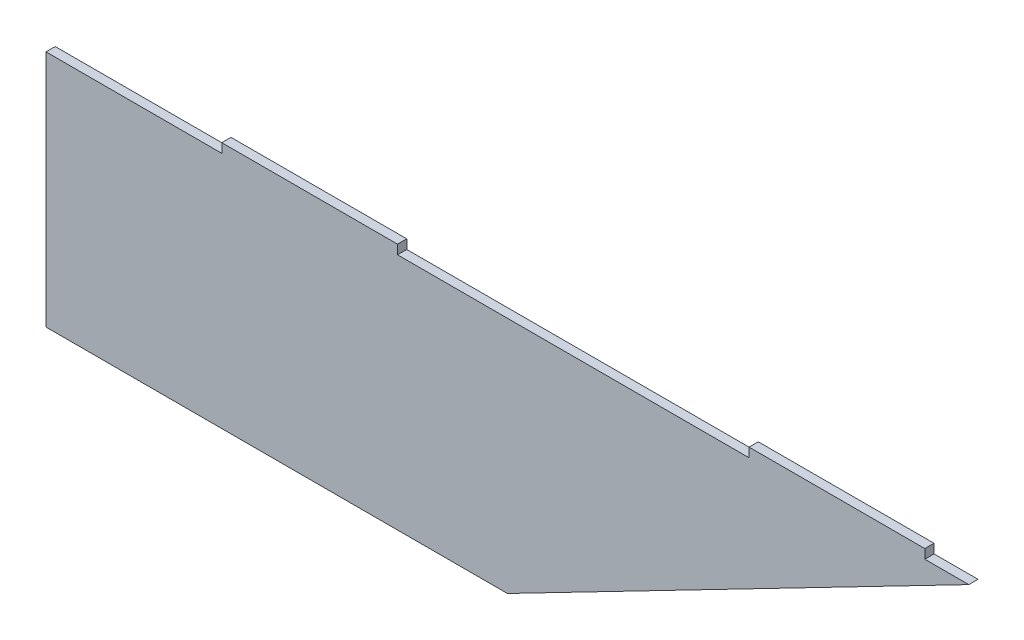
ISO-10303-21;
HEADER;
FILE_DESCRIPTION(('STEP AP214'),'2;1');
FILE_NAME('part.step','',(''),(''),'','','');
FILE_SCHEMA(('AUTOMOTIVE_DESIGN { 1 0 10303 214 1 1 1 1 }'));
ENDSEC;
DATA;
#1=APPLICATION_CONTEXT('core data for automotive mechanical design processes');
#2=APPLICATION_PROTOCOL_DEFINITION('international standard','automotive_design',2000,#1);
#3=PRODUCT_CONTEXT('',#1,'mechanical');
#4=PRODUCT('Part','Part','',(#3));
#5=PRODUCT_RELATED_PRODUCT_CATEGORY('part','',(#4));
#6=PRODUCT_DEFINITION_FORMATION('','',#4);
#7=PRODUCT_DEFINITION_CONTEXT('part definition',#1,'design');
#8=PRODUCT_DEFINITION('design','',#6,#7);
#9=PRODUCT_DEFINITION_SHAPE('','',#8);
#10=(LENGTH_UNIT() NAMED_UNIT(*) SI_UNIT(.MILLI.,.METRE.));
#11=(NAMED_UNIT(*) PLANE_ANGLE_UNIT() SI_UNIT($,.RADIAN.));
#12=(NAMED_UNIT(*) SI_UNIT($,.STERADIAN.) SOLID_ANGLE_UNIT());
#13=UNCERTAINTY_MEASURE_WITH_UNIT(LENGTH_MEASURE(1.E-05),#10,'distance_accuracy_value','');
#14=(GEOMETRIC_REPRESENTATION_CONTEXT(3) GLOBAL_UNCERTAINTY_ASSIGNED_CONTEXT((#13)) GLOBAL_UNIT_ASSIGNED_CONTEXT((#10,
#11,#12)) REPRESENTATION_CONTEXT('',''));
#15=CARTESIAN_POINT('',(0.,0.,0.));
#16=DIRECTION('',(0.,0.,1.));
#17=DIRECTION('',(1.,0.,0.));
#18=AXIS2_PLACEMENT_3D('',#15,#16,#17);
#19=CARTESIAN_POINT('',(150.,0.,3.));
#20=DIRECTION('',(0.,1.,0.));
#21=DIRECTION('',(-1.,0.,0.));
#22=AXIS2_PLACEMENT_3D('',#19,#20,#21);
#23=PLANE('',#22);
#24=DIRECTION('',(1.,0.,0.));
#25=VECTOR('',#24,1.);
#26=CARTESIAN_POINT('',(150.,0.,0.));
#27=LINE('',#26,#25);
#28=CARTESIAN_POINT('',(0.,0.,0.));
#29=VERTEX_POINT('',#28);
#30=CARTESIAN_POINT('',(150.,0.,0.));
#31=VERTEX_POINT('',#30);
#32=EDGE_CURVE('E155',#29,#31,#27,.T.);
#33=ORIENTED_EDGE('',*,*,#32,.T.);
#34=DIRECTION('',(0.,0.,-1.));
#35=VECTOR('',#34,1.);
#36=CARTESIAN_POINT('',(150.,0.,3.));
#37=LINE('',#36,#35);
#38=CARTESIAN_POINT('',(150.,0.,3.));
#39=VERTEX_POINT('',#38);
#40=EDGE_CURVE('E11',#39,#31,#37,.T.);
#41=ORIENTED_EDGE('',*,*,#40,.F.);
#42=DIRECTION('',(1.,0.,0.));
#43=VECTOR('',#42,1.);
#44=CARTESIAN_POINT('',(150.,0.,3.));
#45=LINE('',#44,#43);
#46=CARTESIAN_POINT('',(0.,0.,3.));
#47=VERTEX_POINT('',#46);
#48=EDGE_CURVE('E177',#47,#39,#45,.T.);
#49=ORIENTED_EDGE('',*,*,#48,.F.);
#50=DIRECTION('',(0.,0.,-1.));
#51=VECTOR('',#50,1.);
#52=CARTESIAN_POINT('',(0.,0.,3.));
#53=LINE('',#52,#51);
#54=EDGE_CURVE('E151',#47,#29,#53,.T.);
#55=ORIENTED_EDGE('',*,*,#54,.T.);
#56=EDGE_LOOP('',(#33,#41,#49,#55));
#57=FACE_BOUND('',#56,.T.);
#58=ADVANCED_FACE('F35',(#57),#23,.F.);
#59=CARTESIAN_POINT('',(300.,77.5,3.));
#60=DIRECTION('',(-0.459020051876338,0.888425906857428,0.));
#61=DIRECTION('',(-0.888425906857428,-0.459020051876338,0.));
#62=AXIS2_PLACEMENT_3D('',#59,#60,#61);
#63=PLANE('',#62);
#64=DIRECTION('',(0.888425906857428,0.459020051876338,0.));
#65=VECTOR('',#64,1.);
#66=CARTESIAN_POINT('',(300.,77.5,0.));
#67=LINE('',#66,#65);
#68=CARTESIAN_POINT('',(300.,77.5,0.));
#69=VERTEX_POINT('',#68);
#70=EDGE_CURVE('E158',#31,#69,#67,.T.);
#71=ORIENTED_EDGE('',*,*,#70,.T.);
#72=DIRECTION('',(0.,0.,-1.));
#73=VECTOR('',#72,1.);
#74=CARTESIAN_POINT('',(300.,77.5,3.));
#75=LINE('',#74,#73);
#76=CARTESIAN_POINT('',(300.,77.5,3.));
#77=VERTEX_POINT('',#76);
#78=EDGE_CURVE('E43',#77,#69,#75,.T.);
#79=ORIENTED_EDGE('',*,*,#78,.F.);
#80=DIRECTION('',(0.888425906857428,0.459020051876338,0.));
#81=VECTOR('',#80,1.);
#82=CARTESIAN_POINT('',(300.,77.5,3.));
#83=LINE('',#82,#81);
#84=EDGE_CURVE('E106',#39,#77,#83,.T.);
#85=ORIENTED_EDGE('',*,*,#84,.F.);
#86=ORIENTED_EDGE('',*,*,#40,.T.);
#87=EDGE_LOOP('',(#71,#79,#85,#86));
#88=FACE_BOUND('',#87,.T.);
#89=ADVANCED_FACE('F255',(#88),#63,.F.);
#90=CARTESIAN_POINT('',(285.714285714286,77.5,3.));
#91=DIRECTION('',(0.,-1.,0.));
#92=DIRECTION('',(0.,0.,-1.));
#93=AXIS2_PLACEMENT_3D('',#90,#91,#92);
#94=PLANE('',#93);
#95=DIRECTION('',(-1.,0.,0.));
#96=VECTOR('',#95,1.);
#97=CARTESIAN_POINT('',(285.714285714286,77.5,0.));
#98=LINE('',#97,#96);
#99=CARTESIAN_POINT('',(285.714285714286,77.5,0.));
#100=VERTEX_POINT('',#99);
#101=EDGE_CURVE('E160',#69,#100,#98,.T.);
#102=ORIENTED_EDGE('',*,*,#101,.T.);
#103=DIRECTION('',(0.,0.,-1.));
#104=VECTOR('',#103,1.);
#105=CARTESIAN_POINT('',(285.714285714286,77.5,3.));
#106=LINE('',#105,#104);
#107=CARTESIAN_POINT('',(285.714285714286,77.5,3.));
#108=VERTEX_POINT('',#107);
#109=EDGE_CURVE('E196',#108,#100,#106,.T.);
#110=ORIENTED_EDGE('',*,*,#109,.F.);
#111=DIRECTION('',(-1.,0.,0.));
#112=VECTOR('',#111,1.);
#113=CARTESIAN_POINT('',(285.714285714286,77.5,3.));
#114=LINE('',#113,#112);
#115=EDGE_CURVE('E204',#77,#108,#114,.T.);
#116=ORIENTED_EDGE('',*,*,#115,.F.);
#117=ORIENTED_EDGE('',*,*,#78,.T.);
#118=EDGE_LOOP('',(#102,#110,#116,#117));
#119=FACE_BOUND('',#118,.T.);
#120=ADVANCED_FACE('F202',(#119),#94,.F.);
#121=CARTESIAN_POINT('',(285.714285714286,80.5,3.));
#122=DIRECTION('',(-1.,0.,0.));
#123=DIRECTION('',(0.,0.,1.));
#124=AXIS2_PLACEMENT_3D('',#121,#122,#123);
#125=PLANE('',#124);
#126=DIRECTION('',(0.,1.,0.));
#127=VECTOR('',#126,1.);
#128=CARTESIAN_POINT('',(285.714285714286,80.5,0.));
#129=LINE('',#128,#127);
#130=CARTESIAN_POINT('',(285.714285714286,80.5,0.));
#131=VERTEX_POINT('',#130);
#132=EDGE_CURVE('E162',#100,#131,#129,.T.);
#133=ORIENTED_EDGE('',*,*,#132,.T.);
#134=DIRECTION('',(0.,0.,-1.));
#135=VECTOR('',#134,1.);
#136=CARTESIAN_POINT('',(285.714285714286,80.5,3.));
#137=LINE('',#136,#135);
#138=CARTESIAN_POINT('',(285.714285714286,80.5,3.));
#139=VERTEX_POINT('',#138);
#140=EDGE_CURVE('E193',#139,#131,#137,.T.);
#141=ORIENTED_EDGE('',*,*,#140,.F.);
#142=DIRECTION('',(0.,1.,0.));
#143=VECTOR('',#142,1.);
#144=CARTESIAN_POINT('',(285.714285714286,80.5,3.));
#145=LINE('',#144,#143);
#146=EDGE_CURVE('E222',#108,#139,#145,.T.);
#147=ORIENTED_EDGE('',*,*,#146,.F.);
#148=ORIENTED_EDGE('',*,*,#109,.T.);
#149=EDGE_LOOP('',(#133,#141,#147,#148));
#150=FACE_BOUND('',#149,.T.);
#151=ADVANCED_FACE('F213',(#150),#125,.F.);
#152=CARTESIAN_POINT('',(228.571428571429,80.5,3.));
#153=DIRECTION('',(0.,-1.,0.));
#154=DIRECTION('',(0.,0.,-1.));
#155=AXIS2_PLACEMENT_3D('',#152,#153,#154);
#156=PLANE('',#155);
#157=DIRECTION('',(-1.,0.,0.));
#158=VECTOR('',#157,1.);
#159=CARTESIAN_POINT('',(228.571428571429,80.5,0.));
#160=LINE('',#159,#158);
#161=CARTESIAN_POINT('',(228.571428571429,80.5,0.));
#162=VERTEX_POINT('',#161);
#163=EDGE_CURVE('E164',#131,#162,#160,.T.);
#164=ORIENTED_EDGE('',*,*,#163,.T.);
#165=DIRECTION('',(0.,0.,-1.));
#166=VECTOR('',#165,1.);
#167=CARTESIAN_POINT('',(228.571428571429,80.5,3.));
#168=LINE('',#167,#166);
#169=CARTESIAN_POINT('',(228.571428571429,80.5,3.));
#170=VERTEX_POINT('',#169);
#171=EDGE_CURVE('E190',#170,#162,#168,.T.);
#172=ORIENTED_EDGE('',*,*,#171,.F.);
#173=DIRECTION('',(-1.,0.,0.));
#174=VECTOR('',#173,1.);
#175=CARTESIAN_POINT('',(228.571428571429,80.5,3.));
#176=LINE('',#175,#174);
#177=EDGE_CURVE('E219',#139,#170,#176,.T.);
#178=ORIENTED_EDGE('',*,*,#177,.F.);
#179=ORIENTED_EDGE('',*,*,#140,.T.);
#180=EDGE_LOOP('',(#164,#172,#178,#179));
#181=FACE_BOUND('',#180,.T.);
#182=ADVANCED_FACE('F217',(#181),#156,.F.);
#183=CARTESIAN_POINT('',(228.571428571429,77.5,3.));
#184=DIRECTION('',(1.,0.,0.));
#185=DIRECTION('',(0.,0.,-1.));
#186=AXIS2_PLACEMENT_3D('',#183,#184,#185);
#187=PLANE('',#186);
#188=DIRECTION('',(0.,-1.,0.));
#189=VECTOR('',#188,1.);
#190=CARTESIAN_POINT('',(228.571428571429,77.5,0.));
#191=LINE('',#190,#189);
#192=CARTESIAN_POINT('',(228.571428571429,77.5,0.));
#193=VERTEX_POINT('',#192);
#194=EDGE_CURVE('E166',#162,#193,#191,.T.);
#195=ORIENTED_EDGE('',*,*,#194,.T.);
#196=DIRECTION('',(0.,0.,-1.));
#197=VECTOR('',#196,1.);
#198=CARTESIAN_POINT('',(228.571428571429,77.5,3.));
#199=LINE('',#198,#197);
#200=CARTESIAN_POINT('',(228.571428571429,77.5,3.));
#201=VERTEX_POINT('',#200);
#202=EDGE_CURVE('E187',#201,#193,#199,.T.);
#203=ORIENTED_EDGE('',*,*,#202,.F.);
#204=DIRECTION('',(0.,-1.,0.));
#205=VECTOR('',#204,1.);
#206=CARTESIAN_POINT('',(228.571428571429,77.5,3.));
#207=LINE('',#206,#205);
#208=EDGE_CURVE('E221',#170,#201,#207,.T.);
#209=ORIENTED_EDGE('',*,*,#208,.F.);
#210=ORIENTED_EDGE('',*,*,#171,.T.);
#211=EDGE_LOOP('',(#195,#203,#209,#210));
#212=FACE_BOUND('',#211,.T.);
#213=ADVANCED_FACE('F268',(#212),#187,.F.);
#214=CARTESIAN_POINT('',(114.285714285714,77.5,3.));
#215=DIRECTION('',(0.,-1.,0.));
#216=DIRECTION('',(0.,0.,-1.));
#217=AXIS2_PLACEMENT_3D('',#214,#215,#216);
#218=PLANE('',#217);
#219=DIRECTION('',(-1.,0.,0.));
#220=VECTOR('',#219,1.);
#221=CARTESIAN_POINT('',(114.285714285714,77.5,0.));
#222=LINE('',#221,#220);
#223=CARTESIAN_POINT('',(114.285714285714,77.5,0.));
#224=VERTEX_POINT('',#223);
#225=EDGE_CURVE('E168',#193,#224,#222,.T.);
#226=ORIENTED_EDGE('',*,*,#225,.T.);
#227=DIRECTION('',(0.,0.,-1.));
#228=VECTOR('',#227,1.);
#229=CARTESIAN_POINT('',(114.285714285714,77.5,3.));
#230=LINE('',#229,#228);
#231=CARTESIAN_POINT('',(114.285714285714,77.5,3.));
#232=VERTEX_POINT('',#231);
#233=EDGE_CURVE('E184',#232,#224,#230,.T.);
#234=ORIENTED_EDGE('',*,*,#233,.F.);
#235=DIRECTION('',(-1.,0.,0.));
#236=VECTOR('',#235,1.);
#237=CARTESIAN_POINT('',(114.285714285714,77.5,3.));
#238=LINE('',#237,#236);
#239=EDGE_CURVE('E224',#201,#232,#238,.T.);
#240=ORIENTED_EDGE('',*,*,#239,.F.);
#241=ORIENTED_EDGE('',*,*,#202,.T.);
#242=EDGE_LOOP('',(#226,#234,#240,#241));
#243=FACE_BOUND('',#242,.T.);
#244=ADVANCED_FACE('F271',(#243),#218,.F.);
#245=CARTESIAN_POINT('',(114.285714285714,80.5,3.));
#246=DIRECTION('',(-1.,0.,0.));
#247=DIRECTION('',(0.,0.,1.));
#248=AXIS2_PLACEMENT_3D('',#245,#246,#247);
#249=PLANE('',#248);
#250=DIRECTION('',(0.,1.,0.));
#251=VECTOR('',#250,1.);
#252=CARTESIAN_POINT('',(114.285714285714,80.5,0.));
#253=LINE('',#252,#251);
#254=CARTESIAN_POINT('',(114.285714285714,80.5,0.));
#255=VERTEX_POINT('',#254);
#256=EDGE_CURVE('E170',#224,#255,#253,.T.);
#257=ORIENTED_EDGE('',*,*,#256,.T.);
#258=DIRECTION('',(0.,0.,-1.));
#259=VECTOR('',#258,1.);
#260=CARTESIAN_POINT('',(114.285714285714,80.5,3.));
#261=LINE('',#260,#259);
#262=CARTESIAN_POINT('',(114.285714285714,80.5,3.));
#263=VERTEX_POINT('',#262);
#264=EDGE_CURVE('E181',#263,#255,#261,.T.);
#265=ORIENTED_EDGE('',*,*,#264,.F.);
#266=DIRECTION('',(0.,1.,0.));
#267=VECTOR('',#266,1.);
#268=CARTESIAN_POINT('',(114.285714285714,80.5,3.));
#269=LINE('',#268,#267);
#270=EDGE_CURVE('E230',#232,#263,#269,.T.);
#271=ORIENTED_EDGE('',*,*,#270,.F.);
#272=ORIENTED_EDGE('',*,*,#233,.T.);
#273=EDGE_LOOP('',(#257,#265,#271,#272));
#274=FACE_BOUND('',#273,.T.);
#275=ADVANCED_FACE('F236',(#274),#249,.F.);
#276=CARTESIAN_POINT('',(57.1428571428571,80.5,3.));
#277=DIRECTION('',(0.,-1.,0.));
#278=DIRECTION('',(0.,0.,-1.));
#279=AXIS2_PLACEMENT_3D('',#276,#277,#278);
#280=PLANE('',#279);
#281=DIRECTION('',(-1.,0.,0.));
#282=VECTOR('',#281,1.);
#283=CARTESIAN_POINT('',(57.1428571428571,80.5,0.));
#284=LINE('',#283,#282);
#285=CARTESIAN_POINT('',(57.1428571428571,80.5,0.));
#286=VERTEX_POINT('',#285);
#287=EDGE_CURVE('E172',#255,#286,#284,.T.);
#288=ORIENTED_EDGE('',*,*,#287,.T.);
#289=DIRECTION('',(0.,0.,-1.));
#290=VECTOR('',#289,1.);
#291=CARTESIAN_POINT('',(57.1428571428571,80.5,3.));
#292=LINE('',#291,#290);
#293=CARTESIAN_POINT('',(57.1428571428571,80.5,3.));
#294=VERTEX_POINT('',#293);
#295=EDGE_CURVE('E146',#294,#286,#292,.T.);
#296=ORIENTED_EDGE('',*,*,#295,.F.);
#297=DIRECTION('',(-1.,0.,0.));
#298=VECTOR('',#297,1.);
#299=CARTESIAN_POINT('',(57.1428571428571,80.5,3.));
#300=LINE('',#299,#298);
#301=EDGE_CURVE('E137',#263,#294,#300,.T.);
#302=ORIENTED_EDGE('',*,*,#301,.F.);
#303=ORIENTED_EDGE('',*,*,#264,.T.);
#304=EDGE_LOOP('',(#288,#296,#302,#303));
#305=FACE_BOUND('',#304,.T.);
#306=ADVANCED_FACE('F240',(#305),#280,.F.);
#307=CARTESIAN_POINT('',(57.1428571428571,77.5,3.));
#308=DIRECTION('',(1.,0.,0.));
#309=DIRECTION('',(0.,0.,-1.));
#310=AXIS2_PLACEMENT_3D('',#307,#308,#309);
#311=PLANE('',#310);
#312=DIRECTION('',(0.,-1.,0.));
#313=VECTOR('',#312,1.);
#314=CARTESIAN_POINT('',(57.1428571428571,77.5,0.));
#315=LINE('',#314,#313);
#316=CARTESIAN_POINT('',(57.1428571428571,77.5,0.));
#317=VERTEX_POINT('',#316);
#318=EDGE_CURVE('E145',#286,#317,#315,.T.);
#319=ORIENTED_EDGE('',*,*,#318,.T.);
#320=DIRECTION('',(0.,0.,-1.));
#321=VECTOR('',#320,1.);
#322=CARTESIAN_POINT('',(57.1428571428571,77.5,3.));
#323=LINE('',#322,#321);
#324=CARTESIAN_POINT('',(57.1428571428571,77.5,3.));
#325=VERTEX_POINT('',#324);
#326=EDGE_CURVE('E142',#325,#317,#323,.T.);
#327=ORIENTED_EDGE('',*,*,#326,.F.);
#328=DIRECTION('',(0.,-1.,0.));
#329=VECTOR('',#328,1.);
#330=CARTESIAN_POINT('',(57.1428571428571,77.5,3.));
#331=LINE('',#330,#329);
#332=EDGE_CURVE('E131',#294,#325,#331,.T.);
#333=ORIENTED_EDGE('',*,*,#332,.F.);
#334=ORIENTED_EDGE('',*,*,#295,.T.);
#335=EDGE_LOOP('',(#319,#327,#333,#334));
#336=FACE_BOUND('',#335,.T.);
#337=ADVANCED_FACE('F143',(#336),#311,.F.);
#338=CARTESIAN_POINT('',(0.,77.5,3.));
#339=DIRECTION('',(0.,-1.,0.));
#340=DIRECTION('',(0.,0.,-1.));
#341=AXIS2_PLACEMENT_3D('',#338,#339,#340);
#342=PLANE('',#341);
#343=DIRECTION('',(-1.,0.,0.));
#344=VECTOR('',#343,1.);
#345=CARTESIAN_POINT('',(0.,77.5,0.));
#346=LINE('',#345,#344);
#347=CARTESIAN_POINT('',(0.,77.5,0.));
#348=VERTEX_POINT('',#347);
#349=EDGE_CURVE('E92',#317,#348,#346,.T.);
#350=ORIENTED_EDGE('',*,*,#349,.T.);
#351=DIRECTION('',(0.,0.,-1.));
#352=VECTOR('',#351,1.);
#353=CARTESIAN_POINT('',(0.,77.5,3.));
#354=LINE('',#353,#352);
#355=CARTESIAN_POINT('',(0.,77.5,3.));
#356=VERTEX_POINT('',#355);
#357=EDGE_CURVE('E147',#356,#348,#354,.T.);
#358=ORIENTED_EDGE('',*,*,#357,.F.);
#359=DIRECTION('',(-1.,0.,0.));
#360=VECTOR('',#359,1.);
#361=CARTESIAN_POINT('',(0.,77.5,3.));
#362=LINE('',#361,#360);
#363=EDGE_CURVE('E135',#325,#356,#362,.T.);
#364=ORIENTED_EDGE('',*,*,#363,.F.);
#365=ORIENTED_EDGE('',*,*,#326,.T.);
#366=EDGE_LOOP('',(#350,#358,#364,#365));
#367=FACE_BOUND('',#366,.T.);
#368=ADVANCED_FACE('F149',(#367),#342,.F.);
#369=CARTESIAN_POINT('',(0.,0.,3.));
#370=DIRECTION('',(1.,0.,0.));
#371=DIRECTION('',(0.,0.,-1.));
#372=AXIS2_PLACEMENT_3D('',#369,#370,#371);
#373=PLANE('',#372);
#374=DIRECTION('',(0.,-1.,0.));
#375=VECTOR('',#374,1.);
#376=CARTESIAN_POINT('',(0.,0.,0.));
#377=LINE('',#376,#375);
#378=EDGE_CURVE('E98',#348,#29,#377,.T.);
#379=ORIENTED_EDGE('',*,*,#378,.T.);
#380=ORIENTED_EDGE('',*,*,#54,.F.);
#381=DIRECTION('',(0.,-1.,0.));
#382=VECTOR('',#381,1.);
#383=CARTESIAN_POINT('',(0.,0.,3.));
#384=LINE('',#383,#382);
#385=EDGE_CURVE('E51',#356,#47,#384,.T.);
#386=ORIENTED_EDGE('',*,*,#385,.F.);
#387=ORIENTED_EDGE('',*,*,#357,.T.);
#388=EDGE_LOOP('',(#379,#380,#386,#387));
#389=FACE_BOUND('',#388,.T.);
#390=ADVANCED_FACE('F244',(#389),#373,.F.);
#391=CARTESIAN_POINT('',(0.,0.,3.));
#392=DIRECTION('',(0.,0.,-1.));
#393=DIRECTION('',(-1.,0.,0.));
#394=AXIS2_PLACEMENT_3D('',#391,#392,#393);
#395=PLANE('',#394);
#396=ORIENTED_EDGE('',*,*,#48,.T.);
#397=ORIENTED_EDGE('',*,*,#84,.T.);
#398=ORIENTED_EDGE('',*,*,#115,.T.);
#399=ORIENTED_EDGE('',*,*,#146,.T.);
#400=ORIENTED_EDGE('',*,*,#177,.T.);
#401=ORIENTED_EDGE('',*,*,#208,.T.);
#402=ORIENTED_EDGE('',*,*,#239,.T.);
#403=ORIENTED_EDGE('',*,*,#270,.T.);
#404=ORIENTED_EDGE('',*,*,#301,.T.);
#405=ORIENTED_EDGE('',*,*,#332,.T.);
#406=ORIENTED_EDGE('',*,*,#363,.T.);
#407=ORIENTED_EDGE('',*,*,#385,.T.);
#408=EDGE_LOOP('',(#396,#397,#398,#399,#400,#401,#402,#403,#404,#405,#406,#407));
#409=FACE_BOUND('',#408,.T.);
#410=ADVANCED_FACE('F133',(#409),#395,.F.);
#411=CARTESIAN_POINT('',(0.,0.,0.));
#412=DIRECTION('',(0.,0.,-1.));
#413=DIRECTION('',(-1.,0.,0.));
#414=AXIS2_PLACEMENT_3D('',#411,#412,#413);
#415=PLANE('',#414);
#416=ORIENTED_EDGE('',*,*,#32,.F.);
#417=ORIENTED_EDGE('',*,*,#378,.F.);
#418=ORIENTED_EDGE('',*,*,#349,.F.);
#419=ORIENTED_EDGE('',*,*,#318,.F.);
#420=ORIENTED_EDGE('',*,*,#287,.F.);
#421=ORIENTED_EDGE('',*,*,#256,.F.);
#422=ORIENTED_EDGE('',*,*,#225,.F.);
#423=ORIENTED_EDGE('',*,*,#194,.F.);
#424=ORIENTED_EDGE('',*,*,#163,.F.);
#425=ORIENTED_EDGE('',*,*,#132,.F.);
#426=ORIENTED_EDGE('',*,*,#101,.F.);
#427=ORIENTED_EDGE('',*,*,#70,.F.);
#428=EDGE_LOOP('',(#416,#417,#418,#419,#420,#421,#422,#423,#424,#425,#426,#427));
#429=FACE_BOUND('',#428,.T.);
#430=ADVANCED_FACE('F208',(#429),#415,.T.);
#431=CLOSED_SHELL('',(#58,#89,#120,#151,#182,#213,#244,#275,#306,#337,#368,#390,#410,#430));
#432=MANIFOLD_SOLID_BREP('B2',#431);
#433=ADVANCED_BREP_SHAPE_REPRESENTATION('',(#18,#432),#14);
#434=SHAPE_DEFINITION_REPRESENTATION(#9,#433);
ENDSEC;
END-ISO-10303-21;
